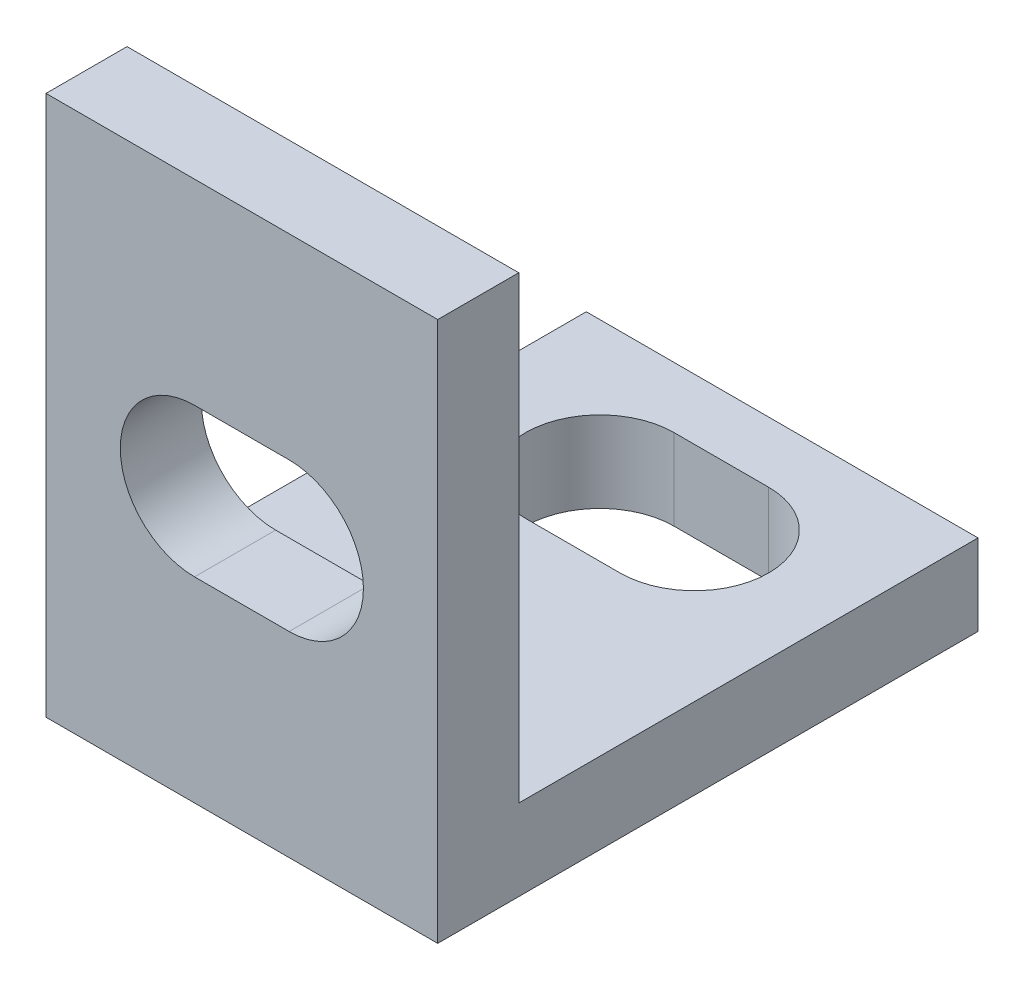
ISO-10303-21;
HEADER;
FILE_DESCRIPTION(('STEP AP214'),'2;1');
FILE_NAME('part.step','',(''),(''),'','','');
FILE_SCHEMA(('AUTOMOTIVE_DESIGN { 1 0 10303 214 1 1 1 1 }'));
ENDSEC;
DATA;
#1=APPLICATION_CONTEXT('core data for automotive mechanical design processes');
#2=APPLICATION_PROTOCOL_DEFINITION('international standard','automotive_design',2000,#1);
#3=PRODUCT_CONTEXT('',#1,'mechanical');
#4=PRODUCT('Part','Part','',(#3));
#5=PRODUCT_RELATED_PRODUCT_CATEGORY('part','',(#4));
#6=PRODUCT_DEFINITION_FORMATION('','',#4);
#7=PRODUCT_DEFINITION_CONTEXT('part definition',#1,'design');
#8=PRODUCT_DEFINITION('design','',#6,#7);
#9=PRODUCT_DEFINITION_SHAPE('','',#8);
#10=(LENGTH_UNIT() NAMED_UNIT(*) SI_UNIT(.MILLI.,.METRE.));
#11=(NAMED_UNIT(*) PLANE_ANGLE_UNIT() SI_UNIT($,.RADIAN.));
#12=(NAMED_UNIT(*) SI_UNIT($,.STERADIAN.) SOLID_ANGLE_UNIT());
#13=UNCERTAINTY_MEASURE_WITH_UNIT(LENGTH_MEASURE(1.E-05),#10,'distance_accuracy_value','');
#14=(GEOMETRIC_REPRESENTATION_CONTEXT(3) GLOBAL_UNCERTAINTY_ASSIGNED_CONTEXT((#13)) GLOBAL_UNIT_ASSIGNED_CONTEXT((#10,
#11,#12)) REPRESENTATION_CONTEXT('',''));
#15=CARTESIAN_POINT('',(0.,0.,0.));
#16=DIRECTION('',(0.,0.,1.));
#17=DIRECTION('',(1.,0.,0.));
#18=AXIS2_PLACEMENT_3D('',#15,#16,#17);
#19=CARTESIAN_POINT('',(-14.5,20.,-3.));
#20=DIRECTION('',(0.,1.,0.));
#21=DIRECTION('',(0.,0.,1.));
#22=AXIS2_PLACEMENT_3D('',#19,#20,#21);
#23=PLANE('',#22);
#24=DIRECTION('',(0.,0.,1.));
#25=VECTOR('',#24,1.);
#26=CARTESIAN_POINT('',(0.,20.,-3.));
#27=LINE('',#26,#25);
#28=CARTESIAN_POINT('',(0.,20.,-3.));
#29=VERTEX_POINT('',#28);
#30=CARTESIAN_POINT('',(0.,20.,0.));
#31=VERTEX_POINT('',#30);
#32=EDGE_CURVE('E194',#29,#31,#27,.T.);
#33=ORIENTED_EDGE('',*,*,#32,.F.);
#34=DIRECTION('',(1.,0.,0.));
#35=VECTOR('',#34,1.);
#36=CARTESIAN_POINT('',(-14.5,20.,-3.));
#37=LINE('',#36,#35);
#38=CARTESIAN_POINT('',(-14.5,20.,-3.));
#39=VERTEX_POINT('',#38);
#40=EDGE_CURVE('E11',#39,#29,#37,.T.);
#41=ORIENTED_EDGE('',*,*,#40,.F.);
#42=DIRECTION('',(0.,0.,1.));
#43=VECTOR('',#42,1.);
#44=CARTESIAN_POINT('',(-14.5,20.,-3.));
#45=LINE('',#44,#43);
#46=CARTESIAN_POINT('',(-14.5,20.,0.));
#47=VERTEX_POINT('',#46);
#48=EDGE_CURVE('E201',#39,#47,#45,.T.);
#49=ORIENTED_EDGE('',*,*,#48,.T.);
#50=DIRECTION('',(1.,0.,0.));
#51=VECTOR('',#50,1.);
#52=CARTESIAN_POINT('',(-14.5,20.,0.));
#53=LINE('',#52,#51);
#54=EDGE_CURVE('E35',#47,#31,#53,.T.);
#55=ORIENTED_EDGE('',*,*,#54,.T.);
#56=EDGE_LOOP('',(#33,#41,#49,#55));
#57=FACE_BOUND('',#56,.T.);
#58=ADVANCED_FACE('F32',(#57),#23,.T.);
#59=CARTESIAN_POINT('',(-14.5,3.,-3.));
#60=DIRECTION('',(0.,0.,-1.));
#61=DIRECTION('',(0.,1.,0.));
#62=AXIS2_PLACEMENT_3D('',#59,#60,#61);
#63=PLANE('',#62);
#64=CARTESIAN_POINT('',(-5.5,10.,-3.));
#65=DIRECTION('',(0.,0.,-1.));
#66=DIRECTION('',(0.,1.,0.));
#67=AXIS2_PLACEMENT_3D('',#64,#65,#66);
#68=CIRCLE('',#67,2.75);
#69=CARTESIAN_POINT('',(-5.5,12.75,-3.));
#70=VERTEX_POINT('',#69);
#71=CARTESIAN_POINT('',(-5.5,7.25,-3.));
#72=VERTEX_POINT('',#71);
#73=EDGE_CURVE('E166',#70,#72,#68,.T.);
#74=ORIENTED_EDGE('',*,*,#73,.F.);
#75=DIRECTION('',(-1.,0.,0.));
#76=VECTOR('',#75,1.);
#77=CARTESIAN_POINT('',(-5.5,12.75,-3.));
#78=LINE('',#77,#76);
#79=CARTESIAN_POINT('',(-9.,12.75,-3.));
#80=VERTEX_POINT('',#79);
#81=EDGE_CURVE('E174',#70,#80,#78,.T.);
#82=ORIENTED_EDGE('',*,*,#81,.T.);
#83=CARTESIAN_POINT('',(-9.,10.,-3.));
#84=DIRECTION('',(0.,0.,-1.));
#85=DIRECTION('',(0.,1.,0.));
#86=AXIS2_PLACEMENT_3D('',#83,#84,#85);
#87=CIRCLE('',#86,2.75);
#88=CARTESIAN_POINT('',(-9.,7.25000000000001,-3.));
#89=VERTEX_POINT('',#88);
#90=EDGE_CURVE('E187',#89,#80,#87,.T.);
#91=ORIENTED_EDGE('',*,*,#90,.F.);
#92=DIRECTION('',(-1.,0.,0.));
#93=VECTOR('',#92,1.);
#94=CARTESIAN_POINT('',(-5.5,7.25,-3.));
#95=LINE('',#94,#93);
#96=EDGE_CURVE('E184',#72,#89,#95,.T.);
#97=ORIENTED_EDGE('',*,*,#96,.F.);
#98=EDGE_LOOP('',(#74,#82,#91,#97));
#99=FACE_BOUND('',#98,.T.);
#100=DIRECTION('',(0.,1.,0.));
#101=VECTOR('',#100,1.);
#102=CARTESIAN_POINT('',(0.,3.,-3.));
#103=LINE('',#102,#101);
#104=CARTESIAN_POINT('',(0.,3.,-3.));
#105=VERTEX_POINT('',#104);
#106=EDGE_CURVE('E205',#105,#29,#103,.T.);
#107=ORIENTED_EDGE('',*,*,#106,.F.);
#108=DIRECTION('',(1.,0.,0.));
#109=VECTOR('',#108,1.);
#110=CARTESIAN_POINT('',(-14.5,3.,-3.));
#111=LINE('',#110,#109);
#112=CARTESIAN_POINT('',(-14.5,3.,-3.));
#113=VERTEX_POINT('',#112);
#114=EDGE_CURVE('E40',#113,#105,#111,.T.);
#115=ORIENTED_EDGE('',*,*,#114,.F.);
#116=DIRECTION('',(0.,1.,0.));
#117=VECTOR('',#116,1.);
#118=CARTESIAN_POINT('',(-14.5,3.,-3.));
#119=LINE('',#118,#117);
#120=EDGE_CURVE('E217',#113,#39,#119,.T.);
#121=ORIENTED_EDGE('',*,*,#120,.T.);
#122=ORIENTED_EDGE('',*,*,#40,.T.);
#123=EDGE_LOOP('',(#107,#115,#121,#122));
#124=FACE_BOUND('',#123,.T.);
#125=ADVANCED_FACE('F254',(#99,#124),#63,.T.);
#126=CARTESIAN_POINT('',(-14.5,3.,-20.));
#127=DIRECTION('',(0.,1.,0.));
#128=DIRECTION('',(0.,0.,1.));
#129=AXIS2_PLACEMENT_3D('',#126,#127,#128);
#130=PLANE('',#129);
#131=CARTESIAN_POINT('',(-5.5,3.,-15.));
#132=DIRECTION('',(0.,1.,0.));
#133=DIRECTION('',(0.,0.,1.));
#134=AXIS2_PLACEMENT_3D('',#131,#132,#133);
#135=CIRCLE('',#134,2.75);
#136=CARTESIAN_POINT('',(-5.5,3.,-12.25));
#137=VERTEX_POINT('',#136);
#138=CARTESIAN_POINT('',(-5.5,3.,-17.75));
#139=VERTEX_POINT('',#138);
#140=EDGE_CURVE('E48',#137,#139,#135,.T.);
#141=ORIENTED_EDGE('',*,*,#140,.F.);
#142=DIRECTION('',(1.,0.,0.));
#143=VECTOR('',#142,1.);
#144=CARTESIAN_POINT('',(-5.5,3.,-12.25));
#145=LINE('',#144,#143);
#146=CARTESIAN_POINT('',(-9.,3.,-12.25));
#147=VERTEX_POINT('',#146);
#148=EDGE_CURVE('E151',#147,#137,#145,.T.);
#149=ORIENTED_EDGE('',*,*,#148,.F.);
#150=CARTESIAN_POINT('',(-9.,3.,-15.));
#151=DIRECTION('',(0.,1.,0.));
#152=DIRECTION('',(0.,0.,1.));
#153=AXIS2_PLACEMENT_3D('',#150,#151,#152);
#154=CIRCLE('',#153,2.75);
#155=CARTESIAN_POINT('',(-9.,3.,-17.75));
#156=VERTEX_POINT('',#155);
#157=EDGE_CURVE('E154',#156,#147,#154,.T.);
#158=ORIENTED_EDGE('',*,*,#157,.F.);
#159=DIRECTION('',(-1.,0.,0.));
#160=VECTOR('',#159,1.);
#161=CARTESIAN_POINT('',(-5.5,3.,-17.75));
#162=LINE('',#161,#160);
#163=EDGE_CURVE('E160',#139,#156,#162,.T.);
#164=ORIENTED_EDGE('',*,*,#163,.F.);
#165=EDGE_LOOP('',(#141,#149,#158,#164));
#166=FACE_BOUND('',#165,.T.);
#167=DIRECTION('',(0.,0.,1.));
#168=VECTOR('',#167,1.);
#169=CARTESIAN_POINT('',(0.,3.,-20.));
#170=LINE('',#169,#168);
#171=CARTESIAN_POINT('',(0.,3.,-20.));
#172=VERTEX_POINT('',#171);
#173=EDGE_CURVE('E231',#172,#105,#170,.T.);
#174=ORIENTED_EDGE('',*,*,#173,.F.);
#175=DIRECTION('',(1.,0.,0.));
#176=VECTOR('',#175,1.);
#177=CARTESIAN_POINT('',(-14.5,3.,-20.));
#178=LINE('',#177,#176);
#179=CARTESIAN_POINT('',(-14.5,3.,-20.));
#180=VERTEX_POINT('',#179);
#181=EDGE_CURVE('E237',#180,#172,#178,.T.);
#182=ORIENTED_EDGE('',*,*,#181,.F.);
#183=DIRECTION('',(0.,0.,1.));
#184=VECTOR('',#183,1.);
#185=CARTESIAN_POINT('',(-14.5,3.,-20.));
#186=LINE('',#185,#184);
#187=EDGE_CURVE('E214',#180,#113,#186,.T.);
#188=ORIENTED_EDGE('',*,*,#187,.T.);
#189=ORIENTED_EDGE('',*,*,#114,.T.);
#190=EDGE_LOOP('',(#174,#182,#188,#189));
#191=FACE_BOUND('',#190,.T.);
#192=ADVANCED_FACE('F265',(#166,#191),#130,.T.);
#193=CARTESIAN_POINT('',(-14.5,0.,-20.));
#194=DIRECTION('',(0.,0.,-1.));
#195=DIRECTION('',(-1.,0.,0.));
#196=AXIS2_PLACEMENT_3D('',#193,#194,#195);
#197=PLANE('',#196);
#198=DIRECTION('',(0.,1.,0.));
#199=VECTOR('',#198,1.);
#200=CARTESIAN_POINT('',(0.,0.,-20.));
#201=LINE('',#200,#199);
#202=CARTESIAN_POINT('',(0.,0.,-20.));
#203=VERTEX_POINT('',#202);
#204=EDGE_CURVE('E228',#203,#172,#201,.T.);
#205=ORIENTED_EDGE('',*,*,#204,.F.);
#206=DIRECTION('',(1.,0.,0.));
#207=VECTOR('',#206,1.);
#208=CARTESIAN_POINT('',(-14.5,0.,-20.));
#209=LINE('',#208,#207);
#210=CARTESIAN_POINT('',(-14.5,0.,-20.));
#211=VERTEX_POINT('',#210);
#212=EDGE_CURVE('E239',#211,#203,#209,.T.);
#213=ORIENTED_EDGE('',*,*,#212,.F.);
#214=DIRECTION('',(0.,1.,0.));
#215=VECTOR('',#214,1.);
#216=CARTESIAN_POINT('',(-14.5,0.,-20.));
#217=LINE('',#216,#215);
#218=EDGE_CURVE('E211',#211,#180,#217,.T.);
#219=ORIENTED_EDGE('',*,*,#218,.T.);
#220=ORIENTED_EDGE('',*,*,#181,.T.);
#221=EDGE_LOOP('',(#205,#213,#219,#220));
#222=FACE_BOUND('',#221,.T.);
#223=ADVANCED_FACE('F263',(#222),#197,.T.);
#224=CARTESIAN_POINT('',(-14.5,0.,0.));
#225=DIRECTION('',(0.,-1.,0.));
#226=DIRECTION('',(0.,0.,-1.));
#227=AXIS2_PLACEMENT_3D('',#224,#225,#226);
#228=PLANE('',#227);
#229=CARTESIAN_POINT('',(-5.5,0.,-15.));
#230=DIRECTION('',(0.,1.,0.));
#231=DIRECTION('',(0.,0.,1.));
#232=AXIS2_PLACEMENT_3D('',#229,#230,#231);
#233=CIRCLE('',#232,2.75);
#234=CARTESIAN_POINT('',(-5.5,0.,-12.25));
#235=VERTEX_POINT('',#234);
#236=CARTESIAN_POINT('',(-5.5,0.,-17.75));
#237=VERTEX_POINT('',#236);
#238=EDGE_CURVE('E135',#235,#237,#233,.T.);
#239=ORIENTED_EDGE('',*,*,#238,.T.);
#240=DIRECTION('',(-1.,0.,0.));
#241=VECTOR('',#240,1.);
#242=CARTESIAN_POINT('',(-5.5,0.,-17.75));
#243=LINE('',#242,#241);
#244=CARTESIAN_POINT('',(-9.,0.,-17.75));
#245=VERTEX_POINT('',#244);
#246=EDGE_CURVE('E144',#237,#245,#243,.T.);
#247=ORIENTED_EDGE('',*,*,#246,.T.);
#248=CARTESIAN_POINT('',(-9.,0.,-15.));
#249=DIRECTION('',(0.,1.,0.));
#250=DIRECTION('',(0.,0.,1.));
#251=AXIS2_PLACEMENT_3D('',#248,#249,#250);
#252=CIRCLE('',#251,2.75);
#253=CARTESIAN_POINT('',(-9.,0.,-12.25));
#254=VERTEX_POINT('',#253);
#255=EDGE_CURVE('E56',#245,#254,#252,.T.);
#256=ORIENTED_EDGE('',*,*,#255,.T.);
#257=DIRECTION('',(1.,0.,0.));
#258=VECTOR('',#257,1.);
#259=CARTESIAN_POINT('',(-5.5,0.,-12.25));
#260=LINE('',#259,#258);
#261=EDGE_CURVE('E141',#254,#235,#260,.T.);
#262=ORIENTED_EDGE('',*,*,#261,.T.);
#263=EDGE_LOOP('',(#239,#247,#256,#262));
#264=FACE_BOUND('',#263,.T.);
#265=DIRECTION('',(0.,0.,-1.));
#266=VECTOR('',#265,1.);
#267=CARTESIAN_POINT('',(0.,0.,0.));
#268=LINE('',#267,#266);
#269=CARTESIAN_POINT('',(0.,0.,0.));
#270=VERTEX_POINT('',#269);
#271=EDGE_CURVE('E225',#270,#203,#268,.T.);
#272=ORIENTED_EDGE('',*,*,#271,.F.);
#273=DIRECTION('',(1.,0.,0.));
#274=VECTOR('',#273,1.);
#275=CARTESIAN_POINT('',(-14.5,0.,0.));
#276=LINE('',#275,#274);
#277=CARTESIAN_POINT('',(-14.5,0.,0.));
#278=VERTEX_POINT('',#277);
#279=EDGE_CURVE('E240',#278,#270,#276,.T.);
#280=ORIENTED_EDGE('',*,*,#279,.F.);
#281=DIRECTION('',(0.,0.,-1.));
#282=VECTOR('',#281,1.);
#283=CARTESIAN_POINT('',(-14.5,0.,0.));
#284=LINE('',#283,#282);
#285=EDGE_CURVE('E208',#278,#211,#284,.T.);
#286=ORIENTED_EDGE('',*,*,#285,.T.);
#287=ORIENTED_EDGE('',*,*,#212,.T.);
#288=EDGE_LOOP('',(#272,#280,#286,#287));
#289=FACE_BOUND('',#288,.T.);
#290=ADVANCED_FACE('F148',(#264,#289),#228,.T.);
#291=CARTESIAN_POINT('',(-14.5,20.,0.));
#292=DIRECTION('',(0.,0.,1.));
#293=DIRECTION('',(0.,-1.,0.));
#294=AXIS2_PLACEMENT_3D('',#291,#292,#293);
#295=PLANE('',#294);
#296=CARTESIAN_POINT('',(-5.5,10.,0.));
#297=DIRECTION('',(0.,0.,-1.));
#298=DIRECTION('',(0.,1.,0.));
#299=AXIS2_PLACEMENT_3D('',#296,#297,#298);
#300=CIRCLE('',#299,2.75);
#301=CARTESIAN_POINT('',(-5.5,12.75,0.));
#302=VERTEX_POINT('',#301);
#303=CARTESIAN_POINT('',(-5.5,7.25,0.));
#304=VERTEX_POINT('',#303);
#305=EDGE_CURVE('E170',#302,#304,#300,.T.);
#306=ORIENTED_EDGE('',*,*,#305,.T.);
#307=DIRECTION('',(-1.,0.,0.));
#308=VECTOR('',#307,1.);
#309=CARTESIAN_POINT('',(-5.5,7.25,0.));
#310=LINE('',#309,#308);
#311=CARTESIAN_POINT('',(-9.,7.25,0.));
#312=VERTEX_POINT('',#311);
#313=EDGE_CURVE('E173',#304,#312,#310,.T.);
#314=ORIENTED_EDGE('',*,*,#313,.T.);
#315=CARTESIAN_POINT('',(-9.,10.,0.));
#316=DIRECTION('',(0.,0.,-1.));
#317=DIRECTION('',(0.,1.,0.));
#318=AXIS2_PLACEMENT_3D('',#315,#316,#317);
#319=CIRCLE('',#318,2.75);
#320=CARTESIAN_POINT('',(-9.,12.75,0.));
#321=VERTEX_POINT('',#320);
#322=EDGE_CURVE('E177',#312,#321,#319,.T.);
#323=ORIENTED_EDGE('',*,*,#322,.T.);
#324=DIRECTION('',(-1.,0.,0.));
#325=VECTOR('',#324,1.);
#326=CARTESIAN_POINT('',(-5.5,12.75,0.));
#327=LINE('',#326,#325);
#328=EDGE_CURVE('E180',#302,#321,#327,.T.);
#329=ORIENTED_EDGE('',*,*,#328,.F.);
#330=EDGE_LOOP('',(#306,#314,#323,#329));
#331=FACE_BOUND('',#330,.T.);
#332=DIRECTION('',(0.,-1.,0.));
#333=VECTOR('',#332,1.);
#334=CARTESIAN_POINT('',(0.,20.,0.));
#335=LINE('',#334,#333);
#336=EDGE_CURVE('E222',#31,#270,#335,.T.);
#337=ORIENTED_EDGE('',*,*,#336,.F.);
#338=ORIENTED_EDGE('',*,*,#54,.F.);
#339=DIRECTION('',(0.,-1.,0.));
#340=VECTOR('',#339,1.);
#341=CARTESIAN_POINT('',(-14.5,20.,0.));
#342=LINE('',#341,#340);
#343=EDGE_CURVE('E204',#47,#278,#342,.T.);
#344=ORIENTED_EDGE('',*,*,#343,.T.);
#345=ORIENTED_EDGE('',*,*,#279,.T.);
#346=EDGE_LOOP('',(#337,#338,#344,#345));
#347=FACE_BOUND('',#346,.T.);
#348=ADVANCED_FACE('F248',(#331,#347),#295,.T.);
#349=CARTESIAN_POINT('',(-14.5,0.,0.));
#350=DIRECTION('',(1.,0.,0.));
#351=DIRECTION('',(0.,0.,-1.));
#352=AXIS2_PLACEMENT_3D('',#349,#350,#351);
#353=PLANE('',#352);
#354=ORIENTED_EDGE('',*,*,#48,.F.);
#355=ORIENTED_EDGE('',*,*,#120,.F.);
#356=ORIENTED_EDGE('',*,*,#187,.F.);
#357=ORIENTED_EDGE('',*,*,#218,.F.);
#358=ORIENTED_EDGE('',*,*,#285,.F.);
#359=ORIENTED_EDGE('',*,*,#343,.F.);
#360=EDGE_LOOP('',(#354,#355,#356,#357,#358,#359));
#361=FACE_BOUND('',#360,.T.);
#362=ADVANCED_FACE('F257',(#361),#353,.F.);
#363=CARTESIAN_POINT('',(0.,0.,0.));
#364=DIRECTION('',(1.,0.,0.));
#365=DIRECTION('',(0.,0.,-1.));
#366=AXIS2_PLACEMENT_3D('',#363,#364,#365);
#367=PLANE('',#366);
#368=ORIENTED_EDGE('',*,*,#32,.T.);
#369=ORIENTED_EDGE('',*,*,#336,.T.);
#370=ORIENTED_EDGE('',*,*,#271,.T.);
#371=ORIENTED_EDGE('',*,*,#204,.T.);
#372=ORIENTED_EDGE('',*,*,#173,.T.);
#373=ORIENTED_EDGE('',*,*,#106,.T.);
#374=EDGE_LOOP('',(#368,#369,#370,#371,#372,#373));
#375=FACE_BOUND('',#374,.T.);
#376=ADVANCED_FACE('F250',(#375),#367,.T.);
#377=CARTESIAN_POINT('',(-5.5,10.,0.));
#378=DIRECTION('',(0.,0.,-1.));
#379=DIRECTION('',(0.,1.,0.));
#380=AXIS2_PLACEMENT_3D('',#377,#378,#379);
#381=CYLINDRICAL_SURFACE('',#380,2.75);
#382=ORIENTED_EDGE('',*,*,#73,.T.);
#383=DIRECTION('',(0.,0.,-1.));
#384=VECTOR('',#383,1.);
#385=CARTESIAN_POINT('',(-5.5,7.25,0.));
#386=LINE('',#385,#384);
#387=EDGE_CURVE('E182',#304,#72,#386,.T.);
#388=ORIENTED_EDGE('',*,*,#387,.F.);
#389=ORIENTED_EDGE('',*,*,#305,.F.);
#390=DIRECTION('',(0.,0.,-1.));
#391=VECTOR('',#390,1.);
#392=CARTESIAN_POINT('',(-5.5,12.75,0.));
#393=LINE('',#392,#391);
#394=EDGE_CURVE('E192',#302,#70,#393,.T.);
#395=ORIENTED_EDGE('',*,*,#394,.T.);
#396=EDGE_LOOP('',(#382,#388,#389,#395));
#397=FACE_BOUND('',#396,.T.);
#398=ADVANCED_FACE('F307',(#397),#381,.F.);
#399=CARTESIAN_POINT('',(-5.5,12.75,0.));
#400=DIRECTION('',(0.,-1.,0.));
#401=DIRECTION('',(0.,0.,-1.));
#402=AXIS2_PLACEMENT_3D('',#399,#400,#401);
#403=PLANE('',#402);
#404=ORIENTED_EDGE('',*,*,#81,.F.);
#405=ORIENTED_EDGE('',*,*,#394,.F.);
#406=ORIENTED_EDGE('',*,*,#328,.T.);
#407=DIRECTION('',(0.,0.,-1.));
#408=VECTOR('',#407,1.);
#409=CARTESIAN_POINT('',(-9.,12.75,0.));
#410=LINE('',#409,#408);
#411=EDGE_CURVE('E195',#321,#80,#410,.T.);
#412=ORIENTED_EDGE('',*,*,#411,.T.);
#413=EDGE_LOOP('',(#404,#405,#406,#412));
#414=FACE_BOUND('',#413,.T.);
#415=ADVANCED_FACE('F312',(#414),#403,.T.);
#416=CARTESIAN_POINT('',(-9.,10.,0.));
#417=DIRECTION('',(0.,0.,-1.));
#418=DIRECTION('',(0.,1.,0.));
#419=AXIS2_PLACEMENT_3D('',#416,#417,#418);
#420=CYLINDRICAL_SURFACE('',#419,2.75);
#421=ORIENTED_EDGE('',*,*,#90,.T.);
#422=ORIENTED_EDGE('',*,*,#411,.F.);
#423=ORIENTED_EDGE('',*,*,#322,.F.);
#424=DIRECTION('',(0.,0.,-1.));
#425=VECTOR('',#424,1.);
#426=CARTESIAN_POINT('',(-9.,7.25000000000001,0.));
#427=LINE('',#426,#425);
#428=EDGE_CURVE('E197',#312,#89,#427,.T.);
#429=ORIENTED_EDGE('',*,*,#428,.T.);
#430=EDGE_LOOP('',(#421,#422,#423,#429));
#431=FACE_BOUND('',#430,.T.);
#432=ADVANCED_FACE('F322',(#431),#420,.F.);
#433=CARTESIAN_POINT('',(-5.5,7.25,0.));
#434=DIRECTION('',(0.,-1.,0.));
#435=DIRECTION('',(1.,0.,0.));
#436=AXIS2_PLACEMENT_3D('',#433,#434,#435);
#437=PLANE('',#436);
#438=ORIENTED_EDGE('',*,*,#96,.T.);
#439=ORIENTED_EDGE('',*,*,#428,.F.);
#440=ORIENTED_EDGE('',*,*,#313,.F.);
#441=ORIENTED_EDGE('',*,*,#387,.T.);
#442=EDGE_LOOP('',(#438,#439,#440,#441));
#443=FACE_BOUND('',#442,.T.);
#444=ADVANCED_FACE('F332',(#443),#437,.F.);
#445=CARTESIAN_POINT('',(-5.5,0.,-15.));
#446=DIRECTION('',(0.,1.,0.));
#447=DIRECTION('',(0.,0.,1.));
#448=AXIS2_PLACEMENT_3D('',#445,#446,#447);
#449=CYLINDRICAL_SURFACE('',#448,2.75);
#450=ORIENTED_EDGE('',*,*,#140,.T.);
#451=DIRECTION('',(0.,1.,0.));
#452=VECTOR('',#451,1.);
#453=CARTESIAN_POINT('',(-5.5,0.,-17.75));
#454=LINE('',#453,#452);
#455=EDGE_CURVE('E131',#237,#139,#454,.T.);
#456=ORIENTED_EDGE('',*,*,#455,.F.);
#457=ORIENTED_EDGE('',*,*,#238,.F.);
#458=DIRECTION('',(0.,1.,0.));
#459=VECTOR('',#458,1.);
#460=CARTESIAN_POINT('',(-5.5,0.,-12.25));
#461=LINE('',#460,#459);
#462=EDGE_CURVE('E164',#235,#137,#461,.T.);
#463=ORIENTED_EDGE('',*,*,#462,.T.);
#464=EDGE_LOOP('',(#450,#456,#457,#463));
#465=FACE_BOUND('',#464,.T.);
#466=ADVANCED_FACE('F133',(#465),#449,.F.);
#467=CARTESIAN_POINT('',(-5.5,0.,-12.25));
#468=DIRECTION('',(0.,0.,1.));
#469=DIRECTION('',(0.,-1.,0.));
#470=AXIS2_PLACEMENT_3D('',#467,#468,#469);
#471=PLANE('',#470);
#472=ORIENTED_EDGE('',*,*,#148,.T.);
#473=ORIENTED_EDGE('',*,*,#462,.F.);
#474=ORIENTED_EDGE('',*,*,#261,.F.);
#475=DIRECTION('',(0.,1.,0.));
#476=VECTOR('',#475,1.);
#477=CARTESIAN_POINT('',(-9.,0.,-12.25));
#478=LINE('',#477,#476);
#479=EDGE_CURVE('E167',#254,#147,#478,.T.);
#480=ORIENTED_EDGE('',*,*,#479,.T.);
#481=EDGE_LOOP('',(#472,#473,#474,#480));
#482=FACE_BOUND('',#481,.T.);
#483=ADVANCED_FACE('F361',(#482),#471,.F.);
#484=CARTESIAN_POINT('',(-9.,0.,-15.));
#485=DIRECTION('',(0.,1.,0.));
#486=DIRECTION('',(0.,0.,1.));
#487=AXIS2_PLACEMENT_3D('',#484,#485,#486);
#488=CYLINDRICAL_SURFACE('',#487,2.75);
#489=ORIENTED_EDGE('',*,*,#157,.T.);
#490=ORIENTED_EDGE('',*,*,#479,.F.);
#491=ORIENTED_EDGE('',*,*,#255,.F.);
#492=DIRECTION('',(0.,1.,0.));
#493=VECTOR('',#492,1.);
#494=CARTESIAN_POINT('',(-9.,0.,-17.75));
#495=LINE('',#494,#493);
#496=EDGE_CURVE('E140',#245,#156,#495,.T.);
#497=ORIENTED_EDGE('',*,*,#496,.T.);
#498=EDGE_LOOP('',(#489,#490,#491,#497));
#499=FACE_BOUND('',#498,.T.);
#500=ADVANCED_FACE('F370',(#499),#488,.F.);
#501=CARTESIAN_POINT('',(-5.5,0.,-17.75));
#502=DIRECTION('',(0.,0.,-1.));
#503=DIRECTION('',(0.,1.,0.));
#504=AXIS2_PLACEMENT_3D('',#501,#502,#503);
#505=PLANE('',#504);
#506=ORIENTED_EDGE('',*,*,#163,.T.);
#507=ORIENTED_EDGE('',*,*,#496,.F.);
#508=ORIENTED_EDGE('',*,*,#246,.F.);
#509=ORIENTED_EDGE('',*,*,#455,.T.);
#510=EDGE_LOOP('',(#506,#507,#508,#509));
#511=FACE_BOUND('',#510,.T.);
#512=ADVANCED_FACE('F145',(#511),#505,.F.);
#513=CLOSED_SHELL('',(#58,#125,#192,#223,#290,#348,#362,#376,#398,#415,#432,#444,#466,#483,#500,#512));
#514=MANIFOLD_SOLID_BREP('B2',#513);
#515=ADVANCED_BREP_SHAPE_REPRESENTATION('',(#18,#514),#14);
#516=SHAPE_DEFINITION_REPRESENTATION(#9,#515);
ENDSEC;
END-ISO-10303-21;
